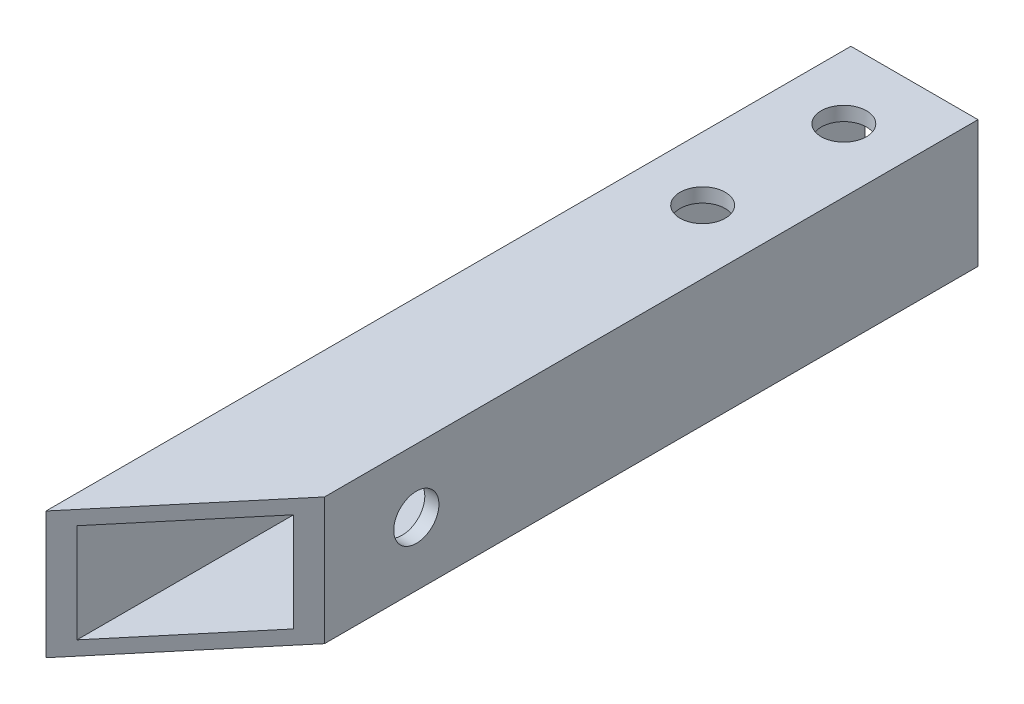
ISO-10303-21;
HEADER;
FILE_DESCRIPTION(('STEP AP214'),'2;1');
FILE_NAME('part.step','',(''),(''),'','','');
FILE_SCHEMA(('AUTOMOTIVE_DESIGN { 1 0 10303 214 1 1 1 1 }'));
ENDSEC;
DATA;
#1=APPLICATION_CONTEXT('core data for automotive mechanical design processes');
#2=APPLICATION_PROTOCOL_DEFINITION('international standard','automotive_design',2000,#1);
#3=PRODUCT_CONTEXT('',#1,'mechanical');
#4=PRODUCT('Part','Part','',(#3));
#5=PRODUCT_RELATED_PRODUCT_CATEGORY('part','',(#4));
#6=PRODUCT_DEFINITION_FORMATION('','',#4);
#7=PRODUCT_DEFINITION_CONTEXT('part definition',#1,'design');
#8=PRODUCT_DEFINITION('design','',#6,#7);
#9=PRODUCT_DEFINITION_SHAPE('','',#8);
#10=(LENGTH_UNIT() NAMED_UNIT(*) SI_UNIT(.MILLI.,.METRE.));
#11=(NAMED_UNIT(*) PLANE_ANGLE_UNIT() SI_UNIT($,.RADIAN.));
#12=(NAMED_UNIT(*) SI_UNIT($,.STERADIAN.) SOLID_ANGLE_UNIT());
#13=UNCERTAINTY_MEASURE_WITH_UNIT(LENGTH_MEASURE(1.E-05),#10,'distance_accuracy_value','');
#14=(GEOMETRIC_REPRESENTATION_CONTEXT(3) GLOBAL_UNCERTAINTY_ASSIGNED_CONTEXT((#13)) GLOBAL_UNIT_ASSIGNED_CONTEXT((#10,
#11,#12)) REPRESENTATION_CONTEXT('',''));
#15=CARTESIAN_POINT('',(0.,0.,0.));
#16=DIRECTION('',(0.,0.,1.));
#17=DIRECTION('',(1.,0.,0.));
#18=AXIS2_PLACEMENT_3D('',#15,#16,#17);
#19=CARTESIAN_POINT('',(4.5,4.5,70.));
#20=DIRECTION('',(-1.,0.,0.));
#21=DIRECTION('',(0.,-1.,0.));
#22=AXIS2_PLACEMENT_3D('',#19,#20,#21);
#23=PLANE('',#22);
#24=CARTESIAN_POINT('',(4.5,0.,39.7742176666521));
#25=DIRECTION('',(1.,0.,0.));
#26=DIRECTION('',(0.,1.,0.));
#27=AXIS2_PLACEMENT_3D('',#24,#25,#26);
#28=CIRCLE('',#27,1.6);
#29=CARTESIAN_POINT('',(4.5,1.6,39.7742176666521));
#30=VERTEX_POINT('',#29);
#31=EDGE_CURVE('E307',#30,#30,#28,.T.);
#32=ORIENTED_EDGE('',*,*,#31,.F.);
#33=EDGE_LOOP('',(#32));
#34=FACE_BOUND('',#33,.T.);
#35=DIRECTION('',(0.,1.,0.));
#36=VECTOR('',#35,1.);
#37=CARTESIAN_POINT('',(4.5,-5.5,46.2742176666521));
#38=LINE('',#37,#36);
#39=CARTESIAN_POINT('',(4.5,-4.5,46.2742176666521));
#40=VERTEX_POINT('',#39);
#41=CARTESIAN_POINT('',(4.5,4.5,46.2742176666521));
#42=VERTEX_POINT('',#41);
#43=EDGE_CURVE('E11',#40,#42,#38,.T.);
#44=ORIENTED_EDGE('',*,*,#43,.F.);
#45=DIRECTION('',(0.,0.,-1.));
#46=VECTOR('',#45,1.);
#47=CARTESIAN_POINT('',(4.5,-4.5,70.));
#48=LINE('',#47,#46);
#49=CARTESIAN_POINT('',(4.5,-4.5,0.));
#50=VERTEX_POINT('',#49);
#51=EDGE_CURVE('E132',#40,#50,#48,.T.);
#52=ORIENTED_EDGE('',*,*,#51,.T.);
#53=DIRECTION('',(0.,1.,0.));
#54=VECTOR('',#53,1.);
#55=CARTESIAN_POINT('',(4.5,4.5,0.));
#56=LINE('',#55,#54);
#57=CARTESIAN_POINT('',(4.5,4.5,0.));
#58=VERTEX_POINT('',#57);
#59=EDGE_CURVE('E114',#50,#58,#56,.T.);
#60=ORIENTED_EDGE('',*,*,#59,.T.);
#61=DIRECTION('',(0.,0.,-1.));
#62=VECTOR('',#61,1.);
#63=CARTESIAN_POINT('',(4.5,4.5,70.));
#64=LINE('',#63,#62);
#65=EDGE_CURVE('E110',#42,#58,#64,.T.);
#66=ORIENTED_EDGE('',*,*,#65,.F.);
#67=EDGE_LOOP('',(#44,#52,#60,#66));
#68=FACE_BOUND('',#67,.T.);
#69=ADVANCED_FACE('F38',(#34,#68),#23,.F.);
#70=CARTESIAN_POINT('',(-4.5,4.5,70.));
#71=DIRECTION('',(0.,-1.,0.));
#72=DIRECTION('',(0.,0.,-1.));
#73=AXIS2_PLACEMENT_3D('',#70,#71,#72);
#74=PLANE('',#73);
#75=CARTESIAN_POINT('',(0.,4.5,5.));
#76=DIRECTION('',(0.,1.,0.));
#77=DIRECTION('',(0.,0.,1.));
#78=AXIS2_PLACEMENT_3D('',#75,#76,#77);
#79=CIRCLE('',#78,1.6);
#80=CARTESIAN_POINT('',(0.,4.5,6.6));
#81=VERTEX_POINT('',#80);
#82=EDGE_CURVE('E202',#81,#81,#79,.T.);
#83=ORIENTED_EDGE('',*,*,#82,.F.);
#84=EDGE_LOOP('',(#83));
#85=FACE_BOUND('',#84,.T.);
#86=CARTESIAN_POINT('',(0.,4.5,15.));
#87=DIRECTION('',(0.,1.,0.));
#88=DIRECTION('',(0.,0.,1.));
#89=AXIS2_PLACEMENT_3D('',#86,#87,#88);
#90=CIRCLE('',#89,1.6);
#91=CARTESIAN_POINT('',(0.,4.5,16.6));
#92=VERTEX_POINT('',#91);
#93=EDGE_CURVE('E203',#92,#92,#90,.T.);
#94=ORIENTED_EDGE('',*,*,#93,.F.);
#95=EDGE_LOOP('',(#94));
#96=FACE_BOUND('',#95,.T.);
#97=DIRECTION('',(0.642787609686538,0.,-0.766044443118979));
#98=VECTOR('',#97,1.);
#99=CARTESIAN_POINT('',(25.4263125610973,4.5,21.3352094922149));
#100=LINE('',#99,#98);
#101=CARTESIAN_POINT('',(-4.5,4.5,57.));
#102=VERTEX_POINT('',#101);
#103=EDGE_CURVE('E101',#102,#42,#100,.T.);
#104=ORIENTED_EDGE('',*,*,#103,.T.);
#105=ORIENTED_EDGE('',*,*,#65,.T.);
#106=DIRECTION('',(-1.,0.,0.));
#107=VECTOR('',#106,1.);
#108=CARTESIAN_POINT('',(-4.5,4.5,0.));
#109=LINE('',#108,#107);
#110=CARTESIAN_POINT('',(-4.5,4.5,0.));
#111=VERTEX_POINT('',#110);
#112=EDGE_CURVE('E119',#58,#111,#109,.T.);
#113=ORIENTED_EDGE('',*,*,#112,.T.);
#114=DIRECTION('',(0.,0.,-1.));
#115=VECTOR('',#114,1.);
#116=CARTESIAN_POINT('',(-4.5,4.5,70.));
#117=LINE('',#116,#115);
#118=EDGE_CURVE('E112',#102,#111,#117,.T.);
#119=ORIENTED_EDGE('',*,*,#118,.F.);
#120=EDGE_LOOP('',(#104,#105,#113,#119));
#121=FACE_BOUND('',#120,.T.);
#122=ADVANCED_FACE('F108',(#85,#96,#121),#74,.F.);
#123=CARTESIAN_POINT('',(-4.5,4.5,70.));
#124=DIRECTION('',(1.,0.,0.));
#125=DIRECTION('',(0.,1.,0.));
#126=AXIS2_PLACEMENT_3D('',#123,#124,#125);
#127=PLANE('',#126);
#128=CARTESIAN_POINT('',(-4.5,0.,39.7742176666521));
#129=DIRECTION('',(1.,0.,0.));
#130=DIRECTION('',(0.,1.,0.));
#131=AXIS2_PLACEMENT_3D('',#128,#129,#130);
#132=CIRCLE('',#131,1.6);
#133=CARTESIAN_POINT('',(-4.5,1.6,39.7742176666521));
#134=VERTEX_POINT('',#133);
#135=EDGE_CURVE('E135',#134,#134,#132,.T.);
#136=ORIENTED_EDGE('',*,*,#135,.T.);
#137=EDGE_LOOP('',(#136));
#138=FACE_BOUND('',#137,.T.);
#139=DIRECTION('',(0.,1.,0.));
#140=VECTOR('',#139,1.);
#141=CARTESIAN_POINT('',(-4.5,-5.5,57.));
#142=LINE('',#141,#140);
#143=CARTESIAN_POINT('',(-4.5,-4.5,57.));
#144=VERTEX_POINT('',#143);
#145=EDGE_CURVE('E57',#144,#102,#142,.T.);
#146=ORIENTED_EDGE('',*,*,#145,.T.);
#147=ORIENTED_EDGE('',*,*,#118,.T.);
#148=DIRECTION('',(0.,-1.,0.));
#149=VECTOR('',#148,1.);
#150=CARTESIAN_POINT('',(-4.5,4.5,0.));
#151=LINE('',#150,#149);
#152=CARTESIAN_POINT('',(-4.5,-4.5,0.));
#153=VERTEX_POINT('',#152);
#154=EDGE_CURVE('E126',#111,#153,#151,.T.);
#155=ORIENTED_EDGE('',*,*,#154,.T.);
#156=DIRECTION('',(0.,0.,-1.));
#157=VECTOR('',#156,1.);
#158=CARTESIAN_POINT('',(-4.5,-4.5,70.));
#159=LINE('',#158,#157);
#160=EDGE_CURVE('E127',#144,#153,#159,.T.);
#161=ORIENTED_EDGE('',*,*,#160,.F.);
#162=EDGE_LOOP('',(#146,#147,#155,#161));
#163=FACE_BOUND('',#162,.T.);
#164=ADVANCED_FACE('F229',(#138,#163),#127,.F.);
#165=CARTESIAN_POINT('',(-4.5,-4.5,70.));
#166=DIRECTION('',(0.,1.,0.));
#167=DIRECTION('',(0.,0.,1.));
#168=AXIS2_PLACEMENT_3D('',#165,#166,#167);
#169=PLANE('',#168);
#170=CARTESIAN_POINT('',(0.,-4.5,5.));
#171=DIRECTION('',(0.,1.,0.));
#172=DIRECTION('',(0.,0.,1.));
#173=AXIS2_PLACEMENT_3D('',#170,#171,#172);
#174=CIRCLE('',#173,1.6);
#175=CARTESIAN_POINT('',(0.,-4.5,6.6));
#176=VERTEX_POINT('',#175);
#177=EDGE_CURVE('E181',#176,#176,#174,.T.);
#178=ORIENTED_EDGE('',*,*,#177,.T.);
#179=EDGE_LOOP('',(#178));
#180=FACE_BOUND('',#179,.T.);
#181=CARTESIAN_POINT('',(0.,-4.5,15.));
#182=DIRECTION('',(0.,1.,0.));
#183=DIRECTION('',(0.,0.,1.));
#184=AXIS2_PLACEMENT_3D('',#181,#182,#183);
#185=CIRCLE('',#184,1.6);
#186=CARTESIAN_POINT('',(0.,-4.5,16.6));
#187=VERTEX_POINT('',#186);
#188=EDGE_CURVE('E131',#187,#187,#185,.T.);
#189=ORIENTED_EDGE('',*,*,#188,.T.);
#190=EDGE_LOOP('',(#189));
#191=FACE_BOUND('',#190,.T.);
#192=DIRECTION('',(0.642787609686538,0.,-0.766044443118979));
#193=VECTOR('',#192,1.);
#194=CARTESIAN_POINT('',(-10.9012503945793,-4.5,64.6287131548351));
#195=LINE('',#194,#193);
#196=EDGE_CURVE('E49',#144,#40,#195,.T.);
#197=ORIENTED_EDGE('',*,*,#196,.F.);
#198=ORIENTED_EDGE('',*,*,#160,.T.);
#199=DIRECTION('',(1.,0.,0.));
#200=VECTOR('',#199,1.);
#201=CARTESIAN_POINT('',(-4.5,-4.5,0.));
#202=LINE('',#201,#200);
#203=EDGE_CURVE('E130',#153,#50,#202,.T.);
#204=ORIENTED_EDGE('',*,*,#203,.T.);
#205=ORIENTED_EDGE('',*,*,#51,.F.);
#206=EDGE_LOOP('',(#197,#198,#204,#205));
#207=FACE_BOUND('',#206,.T.);
#208=ADVANCED_FACE('F233',(#180,#191,#207),#169,.F.);
#209=CARTESIAN_POINT('',(3.5,3.5,70.));
#210=DIRECTION('',(-1.,0.,0.));
#211=DIRECTION('',(0.,-1.,0.));
#212=AXIS2_PLACEMENT_3D('',#209,#210,#211);
#213=PLANE('',#212);
#214=CARTESIAN_POINT('',(3.5,0.,39.7742176666521));
#215=DIRECTION('',(-1.,0.,0.));
#216=DIRECTION('',(0.,-1.,0.));
#217=AXIS2_PLACEMENT_3D('',#214,#215,#216);
#218=CIRCLE('',#217,1.6);
#219=CARTESIAN_POINT('',(3.5,-1.6,39.7742176666521));
#220=VERTEX_POINT('',#219);
#221=EDGE_CURVE('E302',#220,#220,#218,.T.);
#222=ORIENTED_EDGE('',*,*,#221,.F.);
#223=EDGE_LOOP('',(#222));
#224=FACE_BOUND('',#223,.T.);
#225=DIRECTION('',(0.,0.,-1.));
#226=VECTOR('',#225,1.);
#227=CARTESIAN_POINT('',(3.5,-3.5,70.));
#228=LINE('',#227,#226);
#229=CARTESIAN_POINT('',(3.5,-3.5,47.4659712592463));
#230=VERTEX_POINT('',#229);
#231=CARTESIAN_POINT('',(3.5,-3.5,0.));
#232=VERTEX_POINT('',#231);
#233=EDGE_CURVE('E148',#230,#232,#228,.T.);
#234=ORIENTED_EDGE('',*,*,#233,.F.);
#235=DIRECTION('',(0.,1.,0.));
#236=VECTOR('',#235,1.);
#237=CARTESIAN_POINT('',(3.5,3.5,47.4659712592463));
#238=LINE('',#237,#236);
#239=CARTESIAN_POINT('',(3.5,3.5,47.4659712592463));
#240=VERTEX_POINT('',#239);
#241=EDGE_CURVE('E140',#230,#240,#238,.T.);
#242=ORIENTED_EDGE('',*,*,#241,.T.);
#243=DIRECTION('',(0.,0.,-1.));
#244=VECTOR('',#243,1.);
#245=CARTESIAN_POINT('',(3.5,3.5,70.));
#246=LINE('',#245,#244);
#247=CARTESIAN_POINT('',(3.5,3.5,0.));
#248=VERTEX_POINT('',#247);
#249=EDGE_CURVE('E136',#240,#248,#246,.T.);
#250=ORIENTED_EDGE('',*,*,#249,.T.);
#251=DIRECTION('',(0.,1.,0.));
#252=VECTOR('',#251,1.);
#253=CARTESIAN_POINT('',(3.5,3.5,0.));
#254=LINE('',#253,#252);
#255=EDGE_CURVE('E150',#232,#248,#254,.T.);
#256=ORIENTED_EDGE('',*,*,#255,.F.);
#257=EDGE_LOOP('',(#234,#242,#250,#256));
#258=FACE_BOUND('',#257,.T.);
#259=ADVANCED_FACE('F40',(#224,#258),#213,.T.);
#260=CARTESIAN_POINT('',(-3.5,3.5,70.));
#261=DIRECTION('',(0.,-1.,0.));
#262=DIRECTION('',(0.,0.,-1.));
#263=AXIS2_PLACEMENT_3D('',#260,#261,#262);
#264=PLANE('',#263);
#265=CARTESIAN_POINT('',(0.,3.5,5.));
#266=DIRECTION('',(0.,-1.,0.));
#267=DIRECTION('',(0.,0.,-1.));
#268=AXIS2_PLACEMENT_3D('',#265,#266,#267);
#269=CIRCLE('',#268,1.6);
#270=CARTESIAN_POINT('',(0.,3.5,3.4));
#271=VERTEX_POINT('',#270);
#272=EDGE_CURVE('E198',#271,#271,#269,.T.);
#273=ORIENTED_EDGE('',*,*,#272,.F.);
#274=EDGE_LOOP('',(#273));
#275=FACE_BOUND('',#274,.T.);
#276=CARTESIAN_POINT('',(0.,3.5,15.));
#277=DIRECTION('',(0.,-1.,0.));
#278=DIRECTION('',(0.,0.,-1.));
#279=AXIS2_PLACEMENT_3D('',#276,#277,#278);
#280=CIRCLE('',#279,1.6);
#281=CARTESIAN_POINT('',(0.,3.5,13.4));
#282=VERTEX_POINT('',#281);
#283=EDGE_CURVE('E170',#282,#282,#280,.T.);
#284=ORIENTED_EDGE('',*,*,#283,.F.);
#285=EDGE_LOOP('',(#284));
#286=FACE_BOUND('',#285,.T.);
#287=ORIENTED_EDGE('',*,*,#249,.F.);
#288=DIRECTION('',(-0.642787609686538,0.,0.766044443118979));
#289=VECTOR('',#288,1.);
#290=CARTESIAN_POINT('',(-10.4880744834128,3.5,64.136309278329));
#291=LINE('',#290,#289);
#292=CARTESIAN_POINT('',(-3.5,3.5,55.8082464074058));
#293=VERTEX_POINT('',#292);
#294=EDGE_CURVE('E139',#240,#293,#291,.T.);
#295=ORIENTED_EDGE('',*,*,#294,.T.);
#296=DIRECTION('',(0.,0.,-1.));
#297=VECTOR('',#296,1.);
#298=CARTESIAN_POINT('',(-3.5,3.5,70.));
#299=LINE('',#298,#297);
#300=CARTESIAN_POINT('',(-3.5,3.5,0.));
#301=VERTEX_POINT('',#300);
#302=EDGE_CURVE('E141',#293,#301,#299,.T.);
#303=ORIENTED_EDGE('',*,*,#302,.T.);
#304=DIRECTION('',(-1.,0.,0.));
#305=VECTOR('',#304,1.);
#306=CARTESIAN_POINT('',(-3.5,3.5,0.));
#307=LINE('',#306,#305);
#308=EDGE_CURVE('E159',#248,#301,#307,.T.);
#309=ORIENTED_EDGE('',*,*,#308,.F.);
#310=EDGE_LOOP('',(#287,#295,#303,#309));
#311=FACE_BOUND('',#310,.T.);
#312=ADVANCED_FACE('F245',(#275,#286,#311),#264,.T.);
#313=CARTESIAN_POINT('',(-3.5,3.5,70.));
#314=DIRECTION('',(1.,0.,0.));
#315=DIRECTION('',(0.,1.,0.));
#316=AXIS2_PLACEMENT_3D('',#313,#314,#315);
#317=PLANE('',#316);
#318=CARTESIAN_POINT('',(-3.5,0.,39.7742176666521));
#319=DIRECTION('',(1.,0.,0.));
#320=DIRECTION('',(0.,1.,0.));
#321=AXIS2_PLACEMENT_3D('',#318,#319,#320);
#322=CIRCLE('',#321,1.6);
#323=CARTESIAN_POINT('',(-3.5,1.6,39.7742176666521));
#324=VERTEX_POINT('',#323);
#325=EDGE_CURVE('E42',#324,#324,#322,.T.);
#326=ORIENTED_EDGE('',*,*,#325,.F.);
#327=EDGE_LOOP('',(#326));
#328=FACE_BOUND('',#327,.T.);
#329=ORIENTED_EDGE('',*,*,#302,.F.);
#330=DIRECTION('',(0.,-1.,0.));
#331=VECTOR('',#330,1.);
#332=CARTESIAN_POINT('',(-3.5,3.5,55.8082464074058));
#333=LINE('',#332,#331);
#334=CARTESIAN_POINT('',(-3.5,-3.5,55.8082464074058));
#335=VERTEX_POINT('',#334);
#336=EDGE_CURVE('E144',#293,#335,#333,.T.);
#337=ORIENTED_EDGE('',*,*,#336,.T.);
#338=DIRECTION('',(0.,0.,-1.));
#339=VECTOR('',#338,1.);
#340=CARTESIAN_POINT('',(-3.5,-3.5,70.));
#341=LINE('',#340,#339);
#342=CARTESIAN_POINT('',(-3.5,-3.5,0.));
#343=VERTEX_POINT('',#342);
#344=EDGE_CURVE('E145',#335,#343,#341,.T.);
#345=ORIENTED_EDGE('',*,*,#344,.T.);
#346=DIRECTION('',(0.,-1.,0.));
#347=VECTOR('',#346,1.);
#348=CARTESIAN_POINT('',(-3.5,3.5,0.));
#349=LINE('',#348,#347);
#350=EDGE_CURVE('E188',#301,#343,#349,.T.);
#351=ORIENTED_EDGE('',*,*,#350,.F.);
#352=EDGE_LOOP('',(#329,#337,#345,#351));
#353=FACE_BOUND('',#352,.T.);
#354=ADVANCED_FACE('F249',(#328,#353),#317,.T.);
#355=CARTESIAN_POINT('',(-3.5,-3.5,70.));
#356=DIRECTION('',(0.,1.,0.));
#357=DIRECTION('',(0.,0.,1.));
#358=AXIS2_PLACEMENT_3D('',#355,#356,#357);
#359=PLANE('',#358);
#360=CARTESIAN_POINT('',(0.,-3.5,5.));
#361=DIRECTION('',(0.,1.,0.));
#362=DIRECTION('',(0.,0.,1.));
#363=AXIS2_PLACEMENT_3D('',#360,#361,#362);
#364=CIRCLE('',#363,1.6);
#365=CARTESIAN_POINT('',(0.,-3.5,6.6));
#366=VERTEX_POINT('',#365);
#367=EDGE_CURVE('E166',#366,#366,#364,.T.);
#368=ORIENTED_EDGE('',*,*,#367,.F.);
#369=EDGE_LOOP('',(#368));
#370=FACE_BOUND('',#369,.T.);
#371=CARTESIAN_POINT('',(0.,-3.5,15.));
#372=DIRECTION('',(0.,1.,0.));
#373=DIRECTION('',(0.,0.,1.));
#374=AXIS2_PLACEMENT_3D('',#371,#372,#373);
#375=CIRCLE('',#374,1.6);
#376=CARTESIAN_POINT('',(0.,-3.5,16.6));
#377=VERTEX_POINT('',#376);
#378=EDGE_CURVE('E171',#377,#377,#375,.T.);
#379=ORIENTED_EDGE('',*,*,#378,.F.);
#380=EDGE_LOOP('',(#379));
#381=FACE_BOUND('',#380,.T.);
#382=ORIENTED_EDGE('',*,*,#344,.F.);
#383=DIRECTION('',(0.642787609686538,0.,-0.766044443118979));
#384=VECTOR('',#383,1.);
#385=CARTESIAN_POINT('',(-10.4880744834128,-3.5,64.136309278329));
#386=LINE('',#385,#384);
#387=EDGE_CURVE('E147',#335,#230,#386,.T.);
#388=ORIENTED_EDGE('',*,*,#387,.T.);
#389=ORIENTED_EDGE('',*,*,#233,.T.);
#390=DIRECTION('',(1.,0.,0.));
#391=VECTOR('',#390,1.);
#392=CARTESIAN_POINT('',(-3.5,-3.5,0.));
#393=LINE('',#392,#391);
#394=EDGE_CURVE('E175',#343,#232,#393,.T.);
#395=ORIENTED_EDGE('',*,*,#394,.F.);
#396=EDGE_LOOP('',(#382,#388,#389,#395));
#397=FACE_BOUND('',#396,.T.);
#398=ADVANCED_FACE('F239',(#370,#381,#397),#359,.T.);
#399=CARTESIAN_POINT('',(0.,0.,0.));
#400=DIRECTION('',(0.,0.,1.));
#401=DIRECTION('',(1.,0.,0.));
#402=AXIS2_PLACEMENT_3D('',#399,#400,#401);
#403=PLANE('',#402);
#404=ORIENTED_EDGE('',*,*,#59,.F.);
#405=ORIENTED_EDGE('',*,*,#203,.F.);
#406=ORIENTED_EDGE('',*,*,#154,.F.);
#407=ORIENTED_EDGE('',*,*,#112,.F.);
#408=EDGE_LOOP('',(#404,#405,#406,#407));
#409=FACE_BOUND('',#408,.T.);
#410=ORIENTED_EDGE('',*,*,#255,.T.);
#411=ORIENTED_EDGE('',*,*,#308,.T.);
#412=ORIENTED_EDGE('',*,*,#350,.T.);
#413=ORIENTED_EDGE('',*,*,#394,.T.);
#414=EDGE_LOOP('',(#410,#411,#412,#413));
#415=FACE_BOUND('',#414,.T.);
#416=ADVANCED_FACE('F235',(#409,#415),#403,.F.);
#417=CARTESIAN_POINT('',(0.,-45.5,15.));
#418=DIRECTION('',(0.,1.,0.));
#419=DIRECTION('',(0.,0.,1.));
#420=AXIS2_PLACEMENT_3D('',#417,#418,#419);
#421=CYLINDRICAL_SURFACE('',#420,1.6);
#422=ORIENTED_EDGE('',*,*,#378,.T.);
#423=EDGE_LOOP('',(#422));
#424=FACE_BOUND('',#423,.T.);
#425=ORIENTED_EDGE('',*,*,#188,.F.);
#426=EDGE_LOOP('',(#425));
#427=FACE_BOUND('',#426,.T.);
#428=ADVANCED_FACE('F238',(#424,#427),#421,.F.);
#429=CARTESIAN_POINT('',(0.,-45.5,5.));
#430=DIRECTION('',(0.,1.,0.));
#431=DIRECTION('',(0.,0.,1.));
#432=AXIS2_PLACEMENT_3D('',#429,#430,#431);
#433=CYLINDRICAL_SURFACE('',#432,1.6);
#434=ORIENTED_EDGE('',*,*,#367,.T.);
#435=EDGE_LOOP('',(#434));
#436=FACE_BOUND('',#435,.T.);
#437=ORIENTED_EDGE('',*,*,#177,.F.);
#438=EDGE_LOOP('',(#437));
#439=FACE_BOUND('',#438,.T.);
#440=ADVANCED_FACE('F281',(#436,#439),#433,.F.);
#441=ORIENTED_EDGE('',*,*,#283,.T.);
#442=EDGE_LOOP('',(#441));
#443=FACE_BOUND('',#442,.T.);
#444=ORIENTED_EDGE('',*,*,#93,.T.);
#445=EDGE_LOOP('',(#444));
#446=FACE_BOUND('',#445,.T.);
#447=ADVANCED_FACE('F284',(#443,#446),#421,.F.);
#448=ORIENTED_EDGE('',*,*,#272,.T.);
#449=EDGE_LOOP('',(#448));
#450=FACE_BOUND('',#449,.T.);
#451=ORIENTED_EDGE('',*,*,#82,.T.);
#452=EDGE_LOOP('',(#451));
#453=FACE_BOUND('',#452,.T.);
#454=ADVANCED_FACE('F279',(#450,#453),#433,.F.);
#455=CARTESIAN_POINT('',(25.4263125610973,-5.5,21.3352094922149));
#456=DIRECTION('',(0.766044443118979,0.,0.642787609686538));
#457=DIRECTION('',(0.642787609686538,0.,-0.766044443118979));
#458=AXIS2_PLACEMENT_3D('',#455,#456,#457);
#459=PLANE('',#458);
#460=ORIENTED_EDGE('',*,*,#387,.F.);
#461=ORIENTED_EDGE('',*,*,#336,.F.);
#462=ORIENTED_EDGE('',*,*,#294,.F.);
#463=ORIENTED_EDGE('',*,*,#241,.F.);
#464=EDGE_LOOP('',(#460,#461,#462,#463));
#465=FACE_BOUND('',#464,.T.);
#466=ORIENTED_EDGE('',*,*,#196,.T.);
#467=ORIENTED_EDGE('',*,*,#43,.T.);
#468=ORIENTED_EDGE('',*,*,#103,.F.);
#469=ORIENTED_EDGE('',*,*,#145,.F.);
#470=EDGE_LOOP('',(#466,#467,#468,#469));
#471=FACE_BOUND('',#470,.T.);
#472=ADVANCED_FACE('F100',(#465,#471),#459,.T.);
#473=CARTESIAN_POINT('',(-395.5,0.,39.7742176666521));
#474=DIRECTION('',(1.,0.,0.));
#475=DIRECTION('',(0.,1.,0.));
#476=AXIS2_PLACEMENT_3D('',#473,#474,#475);
#477=CYLINDRICAL_SURFACE('',#476,1.6);
#478=ORIENTED_EDGE('',*,*,#325,.T.);
#479=EDGE_LOOP('',(#478));
#480=FACE_BOUND('',#479,.T.);
#481=ORIENTED_EDGE('',*,*,#135,.F.);
#482=EDGE_LOOP('',(#481));
#483=FACE_BOUND('',#482,.T.);
#484=ADVANCED_FACE('F278',(#480,#483),#477,.F.);
#485=ORIENTED_EDGE('',*,*,#221,.T.);
#486=EDGE_LOOP('',(#485));
#487=FACE_BOUND('',#486,.T.);
#488=ORIENTED_EDGE('',*,*,#31,.T.);
#489=EDGE_LOOP('',(#488));
#490=FACE_BOUND('',#489,.T.);
#491=ADVANCED_FACE('F290',(#487,#490),#477,.F.);
#492=CLOSED_SHELL('',(#69,#122,#164,#208,#259,#312,#354,#398,#416,#428,#440,#447,#454,#472,#484,#491));
#493=MANIFOLD_SOLID_BREP('B2',#492);
#494=ADVANCED_BREP_SHAPE_REPRESENTATION('',(#18,#493),#14);
#495=SHAPE_DEFINITION_REPRESENTATION(#9,#494);
ENDSEC;
END-ISO-10303-21;
